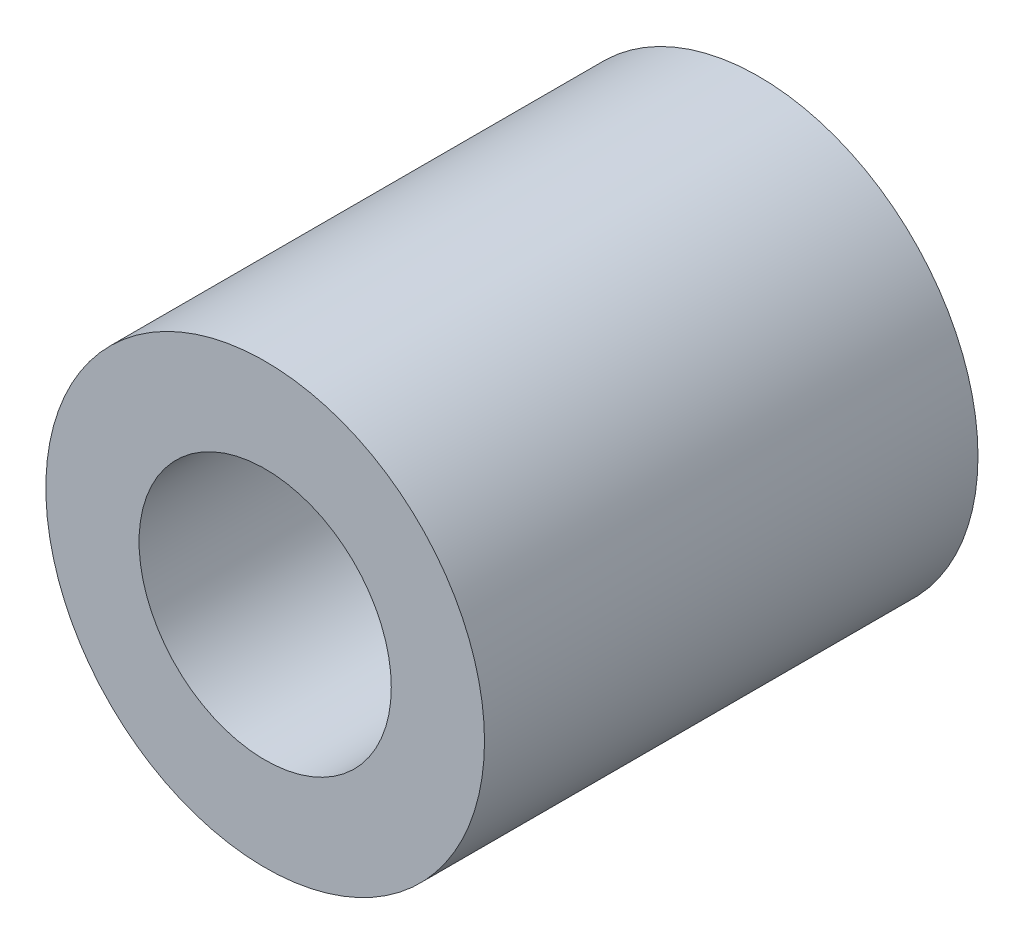
ISO-10303-21;
HEADER;
FILE_DESCRIPTION(('STEP AP214'),'2;1');
FILE_NAME('part.step','',(''),(''),'','','');
FILE_SCHEMA(('AUTOMOTIVE_DESIGN { 1 0 10303 214 1 1 1 1 }'));
ENDSEC;
DATA;
#1=APPLICATION_CONTEXT('core data for automotive mechanical design processes');
#2=APPLICATION_PROTOCOL_DEFINITION('international standard','automotive_design',2000,#1);
#3=PRODUCT_CONTEXT('',#1,'mechanical');
#4=PRODUCT('Part','Part','',(#3));
#5=PRODUCT_RELATED_PRODUCT_CATEGORY('part','',(#4));
#6=PRODUCT_DEFINITION_FORMATION('','',#4);
#7=PRODUCT_DEFINITION_CONTEXT('part definition',#1,'design');
#8=PRODUCT_DEFINITION('design','',#6,#7);
#9=PRODUCT_DEFINITION_SHAPE('','',#8);
#10=(LENGTH_UNIT() NAMED_UNIT(*) SI_UNIT(.MILLI.,.METRE.));
#11=(NAMED_UNIT(*) PLANE_ANGLE_UNIT() SI_UNIT($,.RADIAN.));
#12=(NAMED_UNIT(*) SI_UNIT($,.STERADIAN.) SOLID_ANGLE_UNIT());
#13=UNCERTAINTY_MEASURE_WITH_UNIT(LENGTH_MEASURE(1.E-05),#10,'distance_accuracy_value','');
#14=(GEOMETRIC_REPRESENTATION_CONTEXT(3) GLOBAL_UNCERTAINTY_ASSIGNED_CONTEXT((#13)) GLOBAL_UNIT_ASSIGNED_CONTEXT((#10,
#11,#12)) REPRESENTATION_CONTEXT('',''));
#15=CARTESIAN_POINT('',(0.,0.,0.));
#16=DIRECTION('',(0.,0.,1.));
#17=DIRECTION('',(1.,0.,0.));
#18=AXIS2_PLACEMENT_3D('',#15,#16,#17);
#19=CARTESIAN_POINT('',(0.,0.,9.));
#20=DIRECTION('',(0.,0.,1.));
#21=DIRECTION('',(1.,0.,0.));
#22=AXIS2_PLACEMENT_3D('',#19,#20,#21);
#23=PLANE('',#22);
#24=CARTESIAN_POINT('',(0.,0.,9.));
#25=DIRECTION('',(0.,0.,1.));
#26=DIRECTION('',(1.,0.,0.));
#27=AXIS2_PLACEMENT_3D('',#24,#25,#26);
#28=CIRCLE('',#27,4.);
#29=CARTESIAN_POINT('',(4.,0.,9.));
#30=VERTEX_POINT('',#29);
#31=EDGE_CURVE('E10',#30,#30,#28,.T.);
#32=ORIENTED_EDGE('',*,*,#31,.T.);
#33=EDGE_LOOP('',(#32));
#34=FACE_BOUND('',#33,.T.);
#35=CARTESIAN_POINT('',(0.,0.,9.));
#36=DIRECTION('',(0.,0.,1.));
#37=DIRECTION('',(1.,0.,0.));
#38=AXIS2_PLACEMENT_3D('',#35,#36,#37);
#39=CIRCLE('',#38,2.3);
#40=CARTESIAN_POINT('',(2.3,0.,9.));
#41=VERTEX_POINT('',#40);
#42=EDGE_CURVE('E41',#41,#41,#39,.T.);
#43=ORIENTED_EDGE('',*,*,#42,.F.);
#44=EDGE_LOOP('',(#43));
#45=FACE_BOUND('',#44,.T.);
#46=ADVANCED_FACE('F30',(#34,#45),#23,.T.);
#47=CARTESIAN_POINT('',(0.,0.,0.));
#48=DIRECTION('',(0.,0.,1.));
#49=DIRECTION('',(1.,0.,0.));
#50=AXIS2_PLACEMENT_3D('',#47,#48,#49);
#51=PLANE('',#50);
#52=CARTESIAN_POINT('',(0.,0.,0.));
#53=DIRECTION('',(0.,0.,1.));
#54=DIRECTION('',(1.,0.,0.));
#55=AXIS2_PLACEMENT_3D('',#52,#53,#54);
#56=CIRCLE('',#55,4.);
#57=CARTESIAN_POINT('',(4.,0.,0.));
#58=VERTEX_POINT('',#57);
#59=EDGE_CURVE('E34',#58,#58,#56,.T.);
#60=ORIENTED_EDGE('',*,*,#59,.F.);
#61=EDGE_LOOP('',(#60));
#62=FACE_BOUND('',#61,.T.);
#63=CARTESIAN_POINT('',(0.,0.,0.));
#64=DIRECTION('',(0.,0.,1.));
#65=DIRECTION('',(1.,0.,0.));
#66=AXIS2_PLACEMENT_3D('',#63,#64,#65);
#67=CIRCLE('',#66,2.3);
#68=CARTESIAN_POINT('',(2.3,0.,0.));
#69=VERTEX_POINT('',#68);
#70=EDGE_CURVE('E43',#69,#69,#67,.T.);
#71=ORIENTED_EDGE('',*,*,#70,.T.);
#72=EDGE_LOOP('',(#71));
#73=FACE_BOUND('',#72,.T.);
#74=ADVANCED_FACE('F53',(#62,#73),#51,.F.);
#75=CARTESIAN_POINT('',(0.,0.,9.));
#76=DIRECTION('',(0.,0.,-1.));
#77=DIRECTION('',(-1.,0.,0.));
#78=AXIS2_PLACEMENT_3D('',#75,#76,#77);
#79=CYLINDRICAL_SURFACE('',#78,4.);
#80=ORIENTED_EDGE('',*,*,#31,.F.);
#81=EDGE_LOOP('',(#80));
#82=FACE_BOUND('',#81,.T.);
#83=ORIENTED_EDGE('',*,*,#59,.T.);
#84=EDGE_LOOP('',(#83));
#85=FACE_BOUND('',#84,.T.);
#86=ADVANCED_FACE('F32',(#82,#85),#79,.T.);
#87=CARTESIAN_POINT('',(0.,0.,9.));
#88=DIRECTION('',(0.,0.,-1.));
#89=DIRECTION('',(-1.,0.,0.));
#90=AXIS2_PLACEMENT_3D('',#87,#88,#89);
#91=CYLINDRICAL_SURFACE('',#90,2.3);
#92=ORIENTED_EDGE('',*,*,#42,.T.);
#93=EDGE_LOOP('',(#92));
#94=FACE_BOUND('',#93,.T.);
#95=ORIENTED_EDGE('',*,*,#70,.F.);
#96=EDGE_LOOP('',(#95));
#97=FACE_BOUND('',#96,.T.);
#98=ADVANCED_FACE('F49',(#94,#97),#91,.F.);
#99=CLOSED_SHELL('',(#46,#74,#86,#98));
#100=MANIFOLD_SOLID_BREP('B2',#99);
#101=ADVANCED_BREP_SHAPE_REPRESENTATION('',(#18,#100),#14);
#102=SHAPE_DEFINITION_REPRESENTATION(#9,#101);
ENDSEC;
END-ISO-10303-21;
